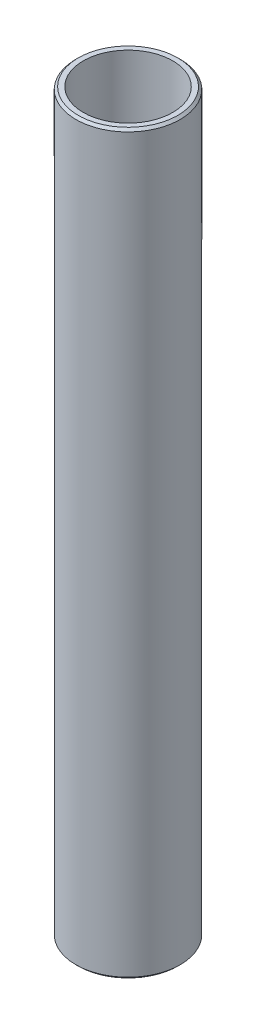
ISO-10303-21;
HEADER;
FILE_DESCRIPTION(('STEP AP214'),'2;1');
FILE_NAME('part.step','',(''),(''),'','','');
FILE_SCHEMA(('AUTOMOTIVE_DESIGN { 1 0 10303 214 1 1 1 1 }'));
ENDSEC;
DATA;
#1=APPLICATION_CONTEXT('core data for automotive mechanical design processes');
#2=APPLICATION_PROTOCOL_DEFINITION('international standard','automotive_design',2000,#1);
#3=PRODUCT_CONTEXT('',#1,'mechanical');
#4=PRODUCT('Part','Part','',(#3));
#5=PRODUCT_RELATED_PRODUCT_CATEGORY('part','',(#4));
#6=PRODUCT_DEFINITION_FORMATION('','',#4);
#7=PRODUCT_DEFINITION_CONTEXT('part definition',#1,'design');
#8=PRODUCT_DEFINITION('design','',#6,#7);
#9=PRODUCT_DEFINITION_SHAPE('','',#8);
#10=(LENGTH_UNIT() NAMED_UNIT(*) SI_UNIT(.MILLI.,.METRE.));
#11=(NAMED_UNIT(*) PLANE_ANGLE_UNIT() SI_UNIT($,.RADIAN.));
#12=(NAMED_UNIT(*) SI_UNIT($,.STERADIAN.) SOLID_ANGLE_UNIT());
#13=UNCERTAINTY_MEASURE_WITH_UNIT(LENGTH_MEASURE(1.E-05),#10,'distance_accuracy_value','');
#14=(GEOMETRIC_REPRESENTATION_CONTEXT(3) GLOBAL_UNCERTAINTY_ASSIGNED_CONTEXT((#13)) GLOBAL_UNIT_ASSIGNED_CONTEXT((#10,
#11,#12)) REPRESENTATION_CONTEXT('',''));
#15=CARTESIAN_POINT('',(0.,0.,0.));
#16=DIRECTION('',(0.,0.,1.));
#17=DIRECTION('',(1.,0.,0.));
#18=AXIS2_PLACEMENT_3D('',#15,#16,#17);
#19=CARTESIAN_POINT('',(0.,600.,0.));
#20=DIRECTION('',(0.,-1.,0.));
#21=DIRECTION('',(0.,0.,-1.));
#22=AXIS2_PLACEMENT_3D('',#19,#20,#21);
#23=CYLINDRICAL_SURFACE('',#22,42.5);
#24=CARTESIAN_POINT('',(0.,598.069492586596,0.));
#25=DIRECTION('',(0.,1.,0.));
#26=DIRECTION('',(0.,0.,1.));
#27=AXIS2_PLACEMENT_3D('',#24,#25,#26);
#28=CIRCLE('',#27,42.5);
#29=CARTESIAN_POINT('',(0.,598.069492586596,-42.5));
#30=VERTEX_POINT('',#29);
#31=EDGE_CURVE('E50',#30,#30,#28,.F.);
#32=CARTESIAN_POINT('',(0.,1.93050741340417,0.));
#33=DIRECTION('',(0.,1.,0.));
#34=DIRECTION('',(0.,0.,1.));
#35=AXIS2_PLACEMENT_3D('',#32,#33,#34);
#36=CIRCLE('',#35,42.5);
#37=CARTESIAN_POINT('',(0.,1.93050741340406,-42.5));
#38=VERTEX_POINT('',#37);
#39=EDGE_CURVE('E51',#38,#38,#36,.T.);
#40=CARTESIAN_POINT('',(0.,598.069492586596,-42.5));
#41=CARTESIAN_POINT('',(0.,591.859711491042,-42.5));
#42=CARTESIAN_POINT('',(0.,585.649930395488,-42.5));
#43=CARTESIAN_POINT('',(0.,573.23036820438,-42.5));
#44=CARTESIAN_POINT('',(0.,567.020587108826,-42.5));
#45=CARTESIAN_POINT('',(0.,554.601024917717,-42.5));
#46=CARTESIAN_POINT('',(0.,548.391243822163,-42.5));
#47=CARTESIAN_POINT('',(0.,535.971681631055,-42.5));
#48=CARTESIAN_POINT('',(0.,529.761900535501,-42.5));
#49=CARTESIAN_POINT('',(0.,517.342338344393,-42.5));
#50=CARTESIAN_POINT('',(0.,511.132557248839,-42.5));
#51=CARTESIAN_POINT('',(0.,498.712995057731,-42.5));
#52=CARTESIAN_POINT('',(0.,492.503213962177,-42.5));
#53=CARTESIAN_POINT('',(0.,480.083651771068,-42.5));
#54=CARTESIAN_POINT('',(0.,473.873870675514,-42.5));
#55=CARTESIAN_POINT('',(0.,461.454308484406,-42.5));
#56=CARTESIAN_POINT('',(0.,455.244527388852,-42.5));
#57=CARTESIAN_POINT('',(0.,442.824965197744,-42.5));
#58=CARTESIAN_POINT('',(0.,436.61518410219,-42.5));
#59=CARTESIAN_POINT('',(0.,424.195621911082,-42.5));
#60=CARTESIAN_POINT('',(0.,417.985840815528,-42.5));
#61=CARTESIAN_POINT('',(0.,405.566278624419,-42.5));
#62=CARTESIAN_POINT('',(0.,399.356497528865,-42.5));
#63=CARTESIAN_POINT('',(0.,386.936935337757,-42.5));
#64=CARTESIAN_POINT('',(0.,380.727154242203,-42.5));
#65=CARTESIAN_POINT('',(0.,368.307592051095,-42.5));
#66=CARTESIAN_POINT('',(0.,362.097810955541,-42.5));
#67=CARTESIAN_POINT('',(0.,349.678248764433,-42.5));
#68=CARTESIAN_POINT('',(0.,343.468467668879,-42.5));
#69=CARTESIAN_POINT('',(0.,331.04890547777,-42.5));
#70=CARTESIAN_POINT('',(0.,324.839124382216,-42.5));
#71=CARTESIAN_POINT('',(0.,312.419562191108,-42.5));
#72=CARTESIAN_POINT('',(0.,306.209781095554,-42.5));
#73=CARTESIAN_POINT('',(0.,293.790218904446,-42.5));
#74=CARTESIAN_POINT('',(0.,287.580437808892,-42.5));
#75=CARTESIAN_POINT('',(0.,275.160875617784,-42.5));
#76=CARTESIAN_POINT('',(0.,268.95109452223,-42.5));
#77=CARTESIAN_POINT('',(0.,256.531532331121,-42.5));
#78=CARTESIAN_POINT('',(0.,250.321751235567,-42.5));
#79=CARTESIAN_POINT('',(0.,237.902189044459,-42.5));
#80=CARTESIAN_POINT('',(0.,231.692407948905,-42.5));
#81=CARTESIAN_POINT('',(0.,219.272845757797,-42.5));
#82=CARTESIAN_POINT('',(0.,213.063064662243,-42.5));
#83=CARTESIAN_POINT('',(0.,200.643502471135,-42.5));
#84=CARTESIAN_POINT('',(0.,194.433721375581,-42.5));
#85=CARTESIAN_POINT('',(0.,182.014159184472,-42.5));
#86=CARTESIAN_POINT('',(0.,175.804378088918,-42.5));
#87=CARTESIAN_POINT('',(0.,163.38481589781,-42.5));
#88=CARTESIAN_POINT('',(0.,157.175034802256,-42.5));
#89=CARTESIAN_POINT('',(0.,144.755472611148,-42.5));
#90=CARTESIAN_POINT('',(0.,138.545691515594,-42.5));
#91=CARTESIAN_POINT('',(0.,126.126129324486,-42.5));
#92=CARTESIAN_POINT('',(0.,119.916348228932,-42.5));
#93=CARTESIAN_POINT('',(0.,107.496786037823,-42.5));
#94=CARTESIAN_POINT('',(0.,101.287004942269,-42.5));
#95=CARTESIAN_POINT('',(0.,88.8674427511612,-42.5));
#96=CARTESIAN_POINT('',(0.,82.6576616556071,-42.5));
#97=CARTESIAN_POINT('',(0.,70.2380994644988,-42.5));
#98=CARTESIAN_POINT('',(0.,64.0283183689448,-42.5));
#99=CARTESIAN_POINT('',(0.,51.6087561778366,-42.5));
#100=CARTESIAN_POINT('',(0.,45.3989750822826,-42.5));
#101=CARTESIAN_POINT('',(0.,32.9794128911744,-42.5));
#102=CARTESIAN_POINT('',(0.,26.7696317956203,-42.5));
#103=CARTESIAN_POINT('',(0.,14.3500696045122,-42.5));
#104=CARTESIAN_POINT('',(0.,8.14028850895813,-42.5));
#105=CARTESIAN_POINT('',(0.,1.93050741340406,-42.5));
#106=B_SPLINE_CURVE_WITH_KNOTS('',3,(#40,#41,#42,#43,#44,#45,#46,#47,#48,#49,#50,#51,#52,#53,
#54,#55,#56,#57,#58,#59,#60,#61,#62,#63,#64,#65,#66,#67,#68,#69,#70,#71,#72,#73,#74,#75,#76,#77,
#78,#79,#80,#81,#82,#83,#84,#85,#86,#87,#88,#89,#90,#91,#92,#93,#94,#95,#96,#97,#98,#99,#100,
#101,#102,#103,#104,#105),.UNSPECIFIED.,.F.,.F.,(4,2,2,2,2,2,2,2,2,2,2,2,2,2,2,2,2,2,2,2,2,2,2,
2,2,2,2,2,2,2,2,2,4),(0.,18.6293432866622,37.2586865733244,55.8880298599866,74.517373146649,
93.1467164333112,111.776059719973,130.405403006636,149.034746293298,167.66408957996,
186.293432866622,204.922776153285,223.552119439947,242.181462726609,260.810806013271,
279.440149299934,298.069492586596,316.698835873258,335.32817915992,353.957522446583,
372.586865733245,391.216209019907,409.845552306569,428.474895593232,447.104238879894,
465.733582166556,484.362925453218,502.992268739881,521.621612026543,540.250955313205,
558.880298599867,577.50964188653,596.138985173192),.UNSPECIFIED.);
#107=EDGE_CURVE('BSEAM39',#30,#38,#106,.T.);
#108=ORIENTED_EDGE('',*,*,#31,.T.);
#109=ORIENTED_EDGE('',*,*,#39,.T.);
#110=ORIENTED_EDGE('',*,*,#107,.T.);
#111=ORIENTED_EDGE('',*,*,#107,.F.);
#112=EDGE_LOOP('',(#108,#110,#109,#111));
#113=FACE_BOUND('',#112,.T.);
#114=ADVANCED_FACE('F39',(#113),#23,.T.);
#115=CARTESIAN_POINT('',(0.,600.,0.));
#116=DIRECTION('',(0.,1.,0.));
#117=DIRECTION('',(0.,0.,1.));
#118=AXIS2_PLACEMENT_3D('',#115,#116,#117);
#119=PLANE('',#118);
#120=CARTESIAN_POINT('',(0.,600.,0.));
#121=DIRECTION('',(0.,1.,0.));
#122=DIRECTION('',(0.,0.,1.));
#123=AXIS2_PLACEMENT_3D('',#120,#121,#122);
#124=CIRCLE('',#123,40.569492586596);
#125=CARTESIAN_POINT('',(0.,600.,-40.569492586596));
#126=VERTEX_POINT('',#125);
#127=EDGE_CURVE('E54',#126,#126,#124,.T.);
#128=ORIENTED_EDGE('',*,*,#127,.T.);
#129=EDGE_LOOP('',(#128));
#130=FACE_BOUND('',#129,.T.);
#131=CARTESIAN_POINT('',(0.,600.,0.));
#132=DIRECTION('',(0.,1.,0.));
#133=DIRECTION('',(0.,0.,1.));
#134=AXIS2_PLACEMENT_3D('',#131,#132,#133);
#135=CIRCLE('',#134,36.4488868457355);
#136=CARTESIAN_POINT('',(0.,600.,36.4488868457355));
#137=VERTEX_POINT('',#136);
#138=EDGE_CURVE('E58',#137,#137,#135,.T.);
#139=ORIENTED_EDGE('',*,*,#138,.F.);
#140=EDGE_LOOP('',(#139));
#141=FACE_BOUND('',#140,.T.);
#142=ADVANCED_FACE('F69',(#130,#141),#119,.T.);
#143=CARTESIAN_POINT('',(0.,0.,0.));
#144=DIRECTION('',(0.,1.,0.));
#145=DIRECTION('',(0.,0.,1.));
#146=AXIS2_PLACEMENT_3D('',#143,#144,#145);
#147=PLANE('',#146);
#148=CARTESIAN_POINT('',(0.,0.,0.));
#149=DIRECTION('',(0.,1.,0.));
#150=DIRECTION('',(0.,0.,1.));
#151=AXIS2_PLACEMENT_3D('',#148,#149,#150);
#152=CIRCLE('',#151,40.5694925865959);
#153=CARTESIAN_POINT('',(0.,0.,40.5694925865959));
#154=VERTEX_POINT('',#153);
#155=EDGE_CURVE('E10',#154,#154,#152,.F.);
#156=ORIENTED_EDGE('',*,*,#155,.T.);
#157=EDGE_LOOP('',(#156));
#158=FACE_BOUND('',#157,.T.);
#159=CARTESIAN_POINT('',(0.,0.,0.));
#160=DIRECTION('',(0.,1.,0.));
#161=DIRECTION('',(0.,0.,1.));
#162=AXIS2_PLACEMENT_3D('',#159,#160,#161);
#163=CIRCLE('',#162,36.4488868457355);
#164=CARTESIAN_POINT('',(0.,0.,36.4488868457355));
#165=VERTEX_POINT('',#164);
#166=EDGE_CURVE('E63',#165,#165,#163,.T.);
#167=ORIENTED_EDGE('',*,*,#166,.T.);
#168=EDGE_LOOP('',(#167));
#169=FACE_BOUND('',#168,.T.);
#170=ADVANCED_FACE('F75',(#158,#169),#147,.F.);
#171=CARTESIAN_POINT('',(0.,600.,0.));
#172=DIRECTION('',(0.,-1.,0.));
#173=DIRECTION('',(0.,0.,-1.));
#174=AXIS2_PLACEMENT_3D('',#171,#172,#173);
#175=CYLINDRICAL_SURFACE('',#174,36.4488868457355);
#176=ORIENTED_EDGE('',*,*,#138,.T.);
#177=EDGE_LOOP('',(#176));
#178=FACE_BOUND('',#177,.T.);
#179=ORIENTED_EDGE('',*,*,#166,.F.);
#180=EDGE_LOOP('',(#179));
#181=FACE_BOUND('',#180,.T.);
#182=ADVANCED_FACE('F70',(#178,#181),#175,.F.);
#183=CARTESIAN_POINT('',(0.,600.,0.));
#184=DIRECTION('',(0.,-1.,0.));
#185=DIRECTION('',(0.,0.,-1.));
#186=AXIS2_PLACEMENT_3D('',#183,#184,#185);
#187=CONICAL_SURFACE('',#186,40.569492586596,0.78539816339747);
#188=CARTESIAN_POINT('',(0.,598.069492586596,-42.5000000000001));
#189=CARTESIAN_POINT('',(0.,598.089602038819,-42.4798905477771));
#190=CARTESIAN_POINT('',(0.,598.109711491042,-42.4597810955541));
#191=CARTESIAN_POINT('',(0.,598.149930395488,-42.4195621911082));
#192=CARTESIAN_POINT('',(0.,598.170039847711,-42.3994527388853));
#193=CARTESIAN_POINT('',(0.,598.210258752157,-42.3592338344394));
#194=CARTESIAN_POINT('',(0.,598.23036820438,-42.3391243822164));
#195=CARTESIAN_POINT('',(0.,598.270587108826,-42.2989054777705));
#196=CARTESIAN_POINT('',(0.,598.290696561049,-42.2787960255475));
#197=CARTESIAN_POINT('',(0.,598.330915465494,-42.2385771211016));
#198=CARTESIAN_POINT('',(0.,598.351024917717,-42.2184676688787));
#199=CARTESIAN_POINT('',(0.,598.391243822163,-42.1782487644327));
#200=CARTESIAN_POINT('',(0.,598.411353274386,-42.1581393122098));
#201=CARTESIAN_POINT('',(0.,598.451572178832,-42.1179204077638));
#202=CARTESIAN_POINT('',(0.,598.471681631055,-42.0978109555409));
#203=CARTESIAN_POINT('',(0.,598.511900535501,-42.057592051095));
#204=CARTESIAN_POINT('',(0.,598.532009987724,-42.037482598872));
#205=CARTESIAN_POINT('',(0.,598.57222889217,-41.9972636944261));
#206=CARTESIAN_POINT('',(0.,598.592338344393,-41.9771542422031));
#207=CARTESIAN_POINT('',(0.,598.632557248839,-41.9369353377572));
#208=CARTESIAN_POINT('',(0.,598.652666701062,-41.9168258855343));
#209=CARTESIAN_POINT('',(0.,598.692885605508,-41.8766069810884));
#210=CARTESIAN_POINT('',(0.,598.712995057731,-41.8564975288654));
#211=CARTESIAN_POINT('',(0.,598.753213962176,-41.8162786244195));
#212=CARTESIAN_POINT('',(0.,598.773323414399,-41.7961691721965));
#213=CARTESIAN_POINT('',(0.,598.813542318845,-41.7559502677506));
#214=CARTESIAN_POINT('',(0.,598.833651771068,-41.7358408155277));
#215=CARTESIAN_POINT('',(0.,598.873870675514,-41.6956219110817));
#216=CARTESIAN_POINT('',(0.,598.893980127737,-41.6755124588588));
#217=CARTESIAN_POINT('',(0.,598.934199032183,-41.6352935544128));
#218=CARTESIAN_POINT('',(0.,598.954308484406,-41.6151841021899));
#219=CARTESIAN_POINT('',(0.,598.994527388852,-41.574965197744));
#220=CARTESIAN_POINT('',(0.,599.014636841075,-41.554855745521));
#221=CARTESIAN_POINT('',(0.,599.054855745521,-41.5146368410751));
#222=CARTESIAN_POINT('',(0.,599.074965197744,-41.4945273888521));
#223=CARTESIAN_POINT('',(0.,599.11518410219,-41.4543084844062));
#224=CARTESIAN_POINT('',(0.,599.135293554413,-41.4341990321833));
#225=CARTESIAN_POINT('',(0.,599.175512458859,-41.3939801277373));
#226=CARTESIAN_POINT('',(0.,599.195621911082,-41.3738706755144));
#227=CARTESIAN_POINT('',(0.,599.235840815527,-41.3336517710685));
#228=CARTESIAN_POINT('',(0.,599.25595026775,-41.3135423188455));
#229=CARTESIAN_POINT('',(0.,599.296169172196,-41.2733234143996));
#230=CARTESIAN_POINT('',(0.,599.316278624419,-41.2532139621766));
#231=CARTESIAN_POINT('',(0.,599.356497528865,-41.2129950577307));
#232=CARTESIAN_POINT('',(0.,599.376606981088,-41.1928856055077));
#233=CARTESIAN_POINT('',(0.,599.416825885534,-41.1526667010618));
#234=CARTESIAN_POINT('',(0.,599.436935337757,-41.1325572488389));
#235=CARTESIAN_POINT('',(0.,599.477154242203,-41.092338344393));
#236=CARTESIAN_POINT('',(0.,599.497263694426,-41.07222889217));
#237=CARTESIAN_POINT('',(0.,599.537482598872,-41.0320099877241));
#238=CARTESIAN_POINT('',(0.,599.557592051095,-41.0119005355011));
#239=CARTESIAN_POINT('',(0.,599.597810955541,-40.9716816310552));
#240=CARTESIAN_POINT('',(0.,599.617920407764,-40.9515721788323));
#241=CARTESIAN_POINT('',(0.,599.65813931221,-40.9113532743863));
#242=CARTESIAN_POINT('',(0.,599.678248764433,-40.8912438221634));
#243=CARTESIAN_POINT('',(0.,599.718467668878,-40.8510249177174));
#244=CARTESIAN_POINT('',(0.,599.738577121101,-40.8309154654945));
#245=CARTESIAN_POINT('',(0.,599.778796025547,-40.7906965610486));
#246=CARTESIAN_POINT('',(0.,599.79890547777,-40.7705871088256));
#247=CARTESIAN_POINT('',(0.,599.839124382216,-40.7303682043797));
#248=CARTESIAN_POINT('',(0.,599.859233834439,-40.7102587521567));
#249=CARTESIAN_POINT('',(0.,599.899452738885,-40.6700398477108));
#250=CARTESIAN_POINT('',(0.,599.919562191108,-40.6499303954879));
#251=CARTESIAN_POINT('',(0.,599.959781095554,-40.609711491042));
#252=CARTESIAN_POINT('',(0.,599.979890547777,-40.589602038819));
#253=CARTESIAN_POINT('',(0.,600.,-40.569492586596));
#254=B_SPLINE_CURVE_WITH_KNOTS('',3,(#188,#189,#190,#191,#192,#193,#194,#195,#196,#197,#198,
#199,#200,#201,#202,#203,#204,#205,#206,#207,#208,#209,#210,#211,#212,#213,#214,#215,#216,#217,
#218,#219,#220,#221,#222,#223,#224,#225,#226,#227,#228,#229,#230,#231,#232,#233,#234,#235,#236,
#237,#238,#239,#240,#241,#242,#243,#244,#245,#246,#247,#248,#249,#250,#251,#252,#253),
.UNSPECIFIED.,.F.,.F.,(4,2,2,2,2,2,2,2,2,2,2,2,2,2,2,2,2,2,2,2,2,2,2,2,2,2,2,2,2,2,2,2,4),(0.,
0.085317180196753,0.170634360393589,0.255951540590342,0.341268720787179,0.42658590098401,
0.511903081180763,0.5972202613776,0.682537441574431,0.767854621771184,0.853171801968021,
0.938488982164774,1.02380616236161,1.10912334255844,1.1944405227552,1.27975770295203,
1.36507488314886,1.45039206334562,1.53570924354245,1.62102642373921,1.70634360393604,
1.79166078413287,1.87697796432963,1.96229514452646,2.04761232472329,2.13292950492005,
2.21824668511688,2.30356386531364,2.38888104551047,2.4741982257073,2.55951540590406,
2.64483258610089,2.73014976629773),.UNSPECIFIED.);
#255=EDGE_CURVE('BSEAM81',#30,#126,#254,.T.);
#256=ORIENTED_EDGE('',*,*,#31,.F.);
#257=ORIENTED_EDGE('',*,*,#127,.F.);
#258=ORIENTED_EDGE('',*,*,#255,.T.);
#259=ORIENTED_EDGE('',*,*,#255,.F.);
#260=EDGE_LOOP('',(#256,#258,#257,#259));
#261=FACE_BOUND('',#260,.T.);
#262=ADVANCED_FACE('F81',(#261),#187,.T.);
#263=CARTESIAN_POINT('',(0.,1.93050741340417,0.));
#264=DIRECTION('',(0.,1.,0.));
#265=DIRECTION('',(0.,0.,1.));
#266=AXIS2_PLACEMENT_3D('',#263,#264,#265);
#267=CONICAL_SURFACE('',#266,42.5,0.785398163397441);
#268=ORIENTED_EDGE('',*,*,#155,.F.);
#269=EDGE_LOOP('',(#268));
#270=FACE_BOUND('',#269,.T.);
#271=ORIENTED_EDGE('',*,*,#39,.F.);
#272=EDGE_LOOP('',(#271));
#273=FACE_BOUND('',#272,.T.);
#274=ADVANCED_FACE('F45',(#270,#273),#267,.T.);
#275=CLOSED_SHELL('',(#114,#142,#170,#182,#262,#274));
#276=MANIFOLD_SOLID_BREP('B2',#275);
#277=ADVANCED_BREP_SHAPE_REPRESENTATION('',(#18,#276),#14);
#278=SHAPE_DEFINITION_REPRESENTATION(#9,#277);
ENDSEC;
END-ISO-10303-21;
